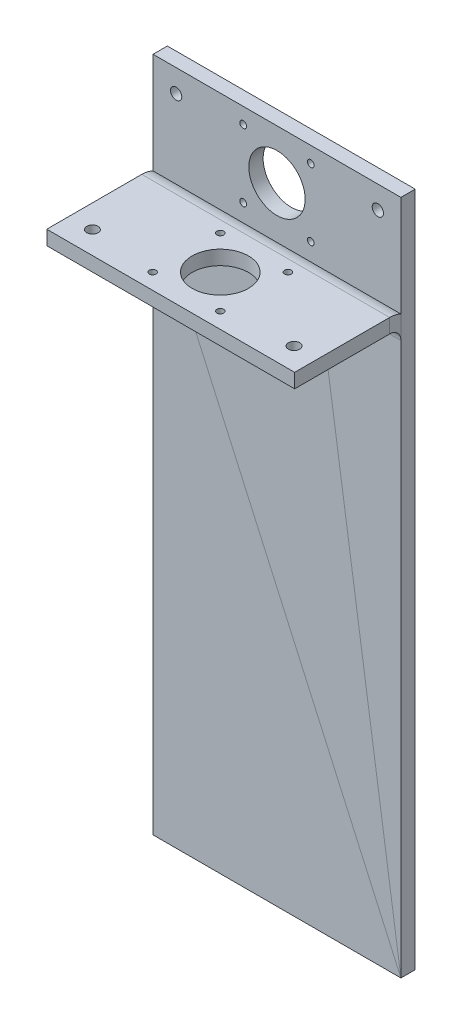
ISO-10303-21;
HEADER;
FILE_DESCRIPTION(('STEP AP214'),'2;1');
FILE_NAME('part.step','',(''),(''),'','','');
FILE_SCHEMA(('AUTOMOTIVE_DESIGN { 1 0 10303 214 1 1 1 1 }'));
ENDSEC;
DATA;
#1=APPLICATION_CONTEXT('core data for automotive mechanical design processes');
#2=APPLICATION_PROTOCOL_DEFINITION('international standard','automotive_design',2000,#1);
#3=PRODUCT_CONTEXT('',#1,'mechanical');
#4=PRODUCT('Part','Part','',(#3));
#5=PRODUCT_RELATED_PRODUCT_CATEGORY('part','',(#4));
#6=PRODUCT_DEFINITION_FORMATION('','',#4);
#7=PRODUCT_DEFINITION_CONTEXT('part definition',#1,'design');
#8=PRODUCT_DEFINITION('design','',#6,#7);
#9=PRODUCT_DEFINITION_SHAPE('','',#8);
#10=(LENGTH_UNIT() NAMED_UNIT(*) SI_UNIT(.MILLI.,.METRE.));
#11=(NAMED_UNIT(*) PLANE_ANGLE_UNIT() SI_UNIT($,.RADIAN.));
#12=(NAMED_UNIT(*) SI_UNIT($,.STERADIAN.) SOLID_ANGLE_UNIT());
#13=UNCERTAINTY_MEASURE_WITH_UNIT(LENGTH_MEASURE(1.E-05),#10,'distance_accuracy_value','');
#14=(GEOMETRIC_REPRESENTATION_CONTEXT(3) GLOBAL_UNCERTAINTY_ASSIGNED_CONTEXT((#13)) GLOBAL_UNIT_ASSIGNED_CONTEXT((#10,
#11,#12)) REPRESENTATION_CONTEXT('',''));
#15=CARTESIAN_POINT('',(0.,0.,0.));
#16=DIRECTION('',(0.,0.,1.));
#17=DIRECTION('',(1.,0.,0.));
#18=AXIS2_PLACEMENT_3D('',#15,#16,#17);
#19=CARTESIAN_POINT('',(0.,256.350000000001,-246.491259971548));
#20=DIRECTION('',(0.,-1.,0.));
#21=DIRECTION('',(1.,0.,0.));
#22=AXIS2_PLACEMENT_3D('',#19,#20,#21);
#23=PLANE('',#22);
#24=CARTESIAN_POINT('',(-99.75,256.35,43.5087400284517));
#25=DIRECTION('',(0.,-1.,0.));
#26=DIRECTION('',(1.,0.,0.));
#27=AXIS2_PLACEMENT_3D('',#24,#25,#26);
#28=CIRCLE('',#27,2.5);
#29=CARTESIAN_POINT('',(-97.25,256.35,43.5087400284517));
#30=VERTEX_POINT('',#29);
#31=EDGE_CURVE('E160',#30,#30,#28,.T.);
#32=ORIENTED_EDGE('',*,*,#31,.T.);
#33=EDGE_LOOP('',(#32));
#34=FACE_BOUND('',#33,.T.);
#35=CARTESIAN_POINT('',(-70.,256.35,46.5087400284517));
#36=DIRECTION('',(0.,-1.,0.));
#37=DIRECTION('',(1.,0.,0.));
#38=AXIS2_PLACEMENT_3D('',#35,#36,#37);
#39=CIRCLE('',#38,1.5);
#40=CARTESIAN_POINT('',(-68.5,256.35,46.5087400284517));
#41=VERTEX_POINT('',#40);
#42=EDGE_CURVE('E163',#41,#41,#39,.T.);
#43=ORIENTED_EDGE('',*,*,#42,.T.);
#44=EDGE_LOOP('',(#43));
#45=FACE_BOUND('',#44,.T.);
#46=CARTESIAN_POINT('',(-40.,256.35,16.5087400284518));
#47=DIRECTION('',(0.,-1.,0.));
#48=DIRECTION('',(1.,0.,0.));
#49=AXIS2_PLACEMENT_3D('',#46,#47,#48);
#50=CIRCLE('',#49,1.5);
#51=CARTESIAN_POINT('',(-38.5,256.35,16.5087400284518));
#52=VERTEX_POINT('',#51);
#53=EDGE_CURVE('E215',#52,#52,#50,.T.);
#54=ORIENTED_EDGE('',*,*,#53,.T.);
#55=EDGE_LOOP('',(#54));
#56=FACE_BOUND('',#55,.T.);
#57=CARTESIAN_POINT('',(-55.,256.35,31.5087400284518));
#58=DIRECTION('',(0.,-1.,0.));
#59=DIRECTION('',(1.,0.,0.));
#60=AXIS2_PLACEMENT_3D('',#57,#58,#59);
#61=CIRCLE('',#60,12.5);
#62=CARTESIAN_POINT('',(-42.5,256.35,31.5087400284518));
#63=VERTEX_POINT('',#62);
#64=EDGE_CURVE('E221',#63,#63,#61,.T.);
#65=ORIENTED_EDGE('',*,*,#64,.T.);
#66=EDGE_LOOP('',(#65));
#67=FACE_BOUND('',#66,.T.);
#68=CARTESIAN_POINT('',(-70.,256.35,16.5087400284518));
#69=DIRECTION('',(0.,-1.,0.));
#70=DIRECTION('',(1.,0.,0.));
#71=AXIS2_PLACEMENT_3D('',#68,#69,#70);
#72=CIRCLE('',#71,1.5);
#73=CARTESIAN_POINT('',(-68.5,256.35,16.5087400284518));
#74=VERTEX_POINT('',#73);
#75=EDGE_CURVE('E224',#74,#74,#72,.T.);
#76=ORIENTED_EDGE('',*,*,#75,.T.);
#77=EDGE_LOOP('',(#76));
#78=FACE_BOUND('',#77,.T.);
#79=CARTESIAN_POINT('',(-40.,256.35,46.5087400284517));
#80=DIRECTION('',(0.,-1.,0.));
#81=DIRECTION('',(1.,0.,0.));
#82=AXIS2_PLACEMENT_3D('',#79,#80,#81);
#83=CIRCLE('',#82,1.5);
#84=CARTESIAN_POINT('',(-38.5,256.35,46.5087400284517));
#85=VERTEX_POINT('',#84);
#86=EDGE_CURVE('E227',#85,#85,#83,.T.);
#87=ORIENTED_EDGE('',*,*,#86,.T.);
#88=EDGE_LOOP('',(#87));
#89=FACE_BOUND('',#88,.T.);
#90=CARTESIAN_POINT('',(-10.25,256.35,43.5087400284517));
#91=DIRECTION('',(0.,-1.,0.));
#92=DIRECTION('',(1.,0.,0.));
#93=AXIS2_PLACEMENT_3D('',#90,#91,#92);
#94=CIRCLE('',#93,2.5);
#95=CARTESIAN_POINT('',(-7.75000000000004,256.35,43.5087400284517));
#96=VERTEX_POINT('',#95);
#97=EDGE_CURVE('E190',#96,#96,#94,.T.);
#98=ORIENTED_EDGE('',*,*,#97,.T.);
#99=EDGE_LOOP('',(#98));
#100=FACE_BOUND('',#99,.T.);
#101=DIRECTION('',(0.,0.,1.));
#102=VECTOR('',#101,1.);
#103=CARTESIAN_POINT('',(0.,256.350000000001,-246.491259971548));
#104=LINE('',#103,#102);
#105=CARTESIAN_POINT('',(0.,256.35,11.3500000000001));
#106=VERTEX_POINT('',#105);
#107=CARTESIAN_POINT('',(0.,256.35,53.5087400284517));
#108=VERTEX_POINT('',#107);
#109=EDGE_CURVE('E75',#106,#108,#104,.T.);
#110=ORIENTED_EDGE('',*,*,#109,.F.);
#111=DIRECTION('',(-1.,0.,0.));
#112=VECTOR('',#111,1.);
#113=CARTESIAN_POINT('',(0.,256.35,11.3500000000001));
#114=LINE('',#113,#112);
#115=CARTESIAN_POINT('',(-110.,256.35,11.3500000000001));
#116=VERTEX_POINT('',#115);
#117=EDGE_CURVE('E67',#106,#116,#114,.T.);
#118=ORIENTED_EDGE('',*,*,#117,.T.);
#119=DIRECTION('',(0.,0.,1.));
#120=VECTOR('',#119,1.);
#121=CARTESIAN_POINT('',(-110.,256.350000000001,-246.491259971548));
#122=LINE('',#121,#120);
#123=CARTESIAN_POINT('',(-110.,256.35,53.5087400284517));
#124=VERTEX_POINT('',#123);
#125=EDGE_CURVE('E83',#124,#116,#122,.F.);
#126=ORIENTED_EDGE('',*,*,#125,.F.);
#127=DIRECTION('',(1.,0.,0.));
#128=VECTOR('',#127,1.);
#129=CARTESIAN_POINT('',(0.,256.35,53.5087400284517));
#130=LINE('',#129,#128);
#131=EDGE_CURVE('E218',#108,#124,#130,.F.);
#132=ORIENTED_EDGE('',*,*,#131,.F.);
#133=EDGE_LOOP('',(#110,#118,#126,#132));
#134=FACE_BOUND('',#133,.T.);
#135=ADVANCED_FACE('F58',(#34,#45,#56,#67,#78,#89,#100,#134),#23,.F.);
#136=CARTESIAN_POINT('',(-110.,250.000000000001,-246.491259971548));
#137=DIRECTION('',(-1.,0.,0.));
#138=DIRECTION('',(0.,0.,-1.));
#139=AXIS2_PLACEMENT_3D('',#136,#137,#138);
#140=PLANE('',#139);
#141=DIRECTION('',(0.,1.,0.));
#142=VECTOR('',#141,1.);
#143=CARTESIAN_POINT('',(-110.,249.999999999998,11.35));
#144=LINE('',#143,#142);
#145=CARTESIAN_POINT('',(-110.,250.,11.35));
#146=VERTEX_POINT('',#145);
#147=EDGE_CURVE('E238',#146,#116,#144,.T.);
#148=ORIENTED_EDGE('',*,*,#147,.F.);
#149=DIRECTION('',(0.,0.,-1.));
#150=VECTOR('',#149,1.);
#151=CARTESIAN_POINT('',(-110.,250.000000000001,-246.491259971548));
#152=LINE('',#151,#150);
#153=CARTESIAN_POINT('',(-110.,250.,53.5087400284517));
#154=VERTEX_POINT('',#153);
#155=EDGE_CURVE('E199',#154,#146,#152,.T.);
#156=ORIENTED_EDGE('',*,*,#155,.F.);
#157=DIRECTION('',(0.,-1.,0.));
#158=VECTOR('',#157,1.);
#159=CARTESIAN_POINT('',(-110.,250.,53.5087400284517));
#160=LINE('',#159,#158);
#161=EDGE_CURVE('E232',#124,#154,#160,.T.);
#162=ORIENTED_EDGE('',*,*,#161,.F.);
#163=ORIENTED_EDGE('',*,*,#125,.T.);
#164=EDGE_LOOP('',(#148,#156,#162,#163));
#165=FACE_BOUND('',#164,.T.);
#166=ADVANCED_FACE('F265',(#165),#140,.T.);
#167=CARTESIAN_POINT('',(0.,250.000000000001,-246.491259971548));
#168=DIRECTION('',(1.,0.,0.));
#169=DIRECTION('',(0.,0.,1.));
#170=AXIS2_PLACEMENT_3D('',#167,#168,#169);
#171=PLANE('',#170);
#172=DIRECTION('',(0.,-1.,0.));
#173=VECTOR('',#172,1.);
#174=CARTESIAN_POINT('',(0.,249.999999999998,11.35));
#175=LINE('',#174,#173);
#176=CARTESIAN_POINT('',(0.,250.,11.35));
#177=VERTEX_POINT('',#176);
#178=EDGE_CURVE('E13',#106,#177,#175,.T.);
#179=ORIENTED_EDGE('',*,*,#178,.F.);
#180=ORIENTED_EDGE('',*,*,#109,.T.);
#181=DIRECTION('',(0.,-1.,0.));
#182=VECTOR('',#181,1.);
#183=CARTESIAN_POINT('',(0.,250.,53.5087400284517));
#184=LINE('',#183,#182);
#185=CARTESIAN_POINT('',(0.,250.,53.5087400284517));
#186=VERTEX_POINT('',#185);
#187=EDGE_CURVE('E211',#108,#186,#184,.T.);
#188=ORIENTED_EDGE('',*,*,#187,.T.);
#189=DIRECTION('',(0.,0.,1.));
#190=VECTOR('',#189,1.);
#191=CARTESIAN_POINT('',(0.,250.000000000001,-246.491259971548));
#192=LINE('',#191,#190);
#193=EDGE_CURVE('E62',#177,#186,#192,.T.);
#194=ORIENTED_EDGE('',*,*,#193,.F.);
#195=EDGE_LOOP('',(#179,#180,#188,#194));
#196=FACE_BOUND('',#195,.T.);
#197=ADVANCED_FACE('F60',(#196),#171,.T.);
#198=CARTESIAN_POINT('',(-99.75,250.,43.5087400284517));
#199=DIRECTION('',(0.,-1.,0.));
#200=DIRECTION('',(1.,0.,0.));
#201=AXIS2_PLACEMENT_3D('',#198,#199,#200);
#202=CYLINDRICAL_SURFACE('',#201,2.5);
#203=CARTESIAN_POINT('',(-99.75,250.,43.5087400284517));
#204=DIRECTION('',(0.,-1.,0.));
#205=DIRECTION('',(1.,0.,0.));
#206=AXIS2_PLACEMENT_3D('',#203,#204,#205);
#207=CIRCLE('',#206,2.5);
#208=CARTESIAN_POINT('',(-97.25,250.,43.5087400284517));
#209=VERTEX_POINT('',#208);
#210=EDGE_CURVE('E186',#209,#209,#207,.T.);
#211=ORIENTED_EDGE('',*,*,#210,.T.);
#212=EDGE_LOOP('',(#211));
#213=FACE_BOUND('',#212,.T.);
#214=ORIENTED_EDGE('',*,*,#31,.F.);
#215=EDGE_LOOP('',(#214));
#216=FACE_BOUND('',#215,.T.);
#217=ADVANCED_FACE('F264',(#213,#216),#202,.F.);
#218=CARTESIAN_POINT('',(-70.,250.,46.5087400284517));
#219=DIRECTION('',(0.,-1.,0.));
#220=DIRECTION('',(1.,0.,0.));
#221=AXIS2_PLACEMENT_3D('',#218,#219,#220);
#222=CYLINDRICAL_SURFACE('',#221,1.5);
#223=CARTESIAN_POINT('',(-70.,250.,46.5087400284517));
#224=DIRECTION('',(0.,-1.,0.));
#225=DIRECTION('',(1.,0.,0.));
#226=AXIS2_PLACEMENT_3D('',#223,#224,#225);
#227=CIRCLE('',#226,1.5);
#228=CARTESIAN_POINT('',(-68.5,250.,46.5087400284517));
#229=VERTEX_POINT('',#228);
#230=EDGE_CURVE('E189',#229,#229,#227,.T.);
#231=ORIENTED_EDGE('',*,*,#230,.T.);
#232=EDGE_LOOP('',(#231));
#233=FACE_BOUND('',#232,.T.);
#234=ORIENTED_EDGE('',*,*,#42,.F.);
#235=EDGE_LOOP('',(#234));
#236=FACE_BOUND('',#235,.T.);
#237=ADVANCED_FACE('F270',(#233,#236),#222,.F.);
#238=CARTESIAN_POINT('',(-40.,250.,16.5087400284518));
#239=DIRECTION('',(0.,-1.,0.));
#240=DIRECTION('',(1.,0.,0.));
#241=AXIS2_PLACEMENT_3D('',#238,#239,#240);
#242=CYLINDRICAL_SURFACE('',#241,1.5);
#243=CARTESIAN_POINT('',(-40.,250.,16.5087400284518));
#244=DIRECTION('',(0.,-1.,0.));
#245=DIRECTION('',(1.,0.,0.));
#246=AXIS2_PLACEMENT_3D('',#243,#244,#245);
#247=CIRCLE('',#246,1.5);
#248=CARTESIAN_POINT('',(-38.5,250.,16.5087400284518));
#249=VERTEX_POINT('',#248);
#250=EDGE_CURVE('E193',#249,#249,#247,.T.);
#251=ORIENTED_EDGE('',*,*,#250,.T.);
#252=EDGE_LOOP('',(#251));
#253=FACE_BOUND('',#252,.T.);
#254=ORIENTED_EDGE('',*,*,#53,.F.);
#255=EDGE_LOOP('',(#254));
#256=FACE_BOUND('',#255,.T.);
#257=ADVANCED_FACE('F301',(#253,#256),#242,.F.);
#258=CARTESIAN_POINT('',(0.,250.,53.5087400284517));
#259=DIRECTION('',(0.,0.,1.));
#260=DIRECTION('',(-1.,0.,0.));
#261=AXIS2_PLACEMENT_3D('',#258,#259,#260);
#262=PLANE('',#261);
#263=ORIENTED_EDGE('',*,*,#131,.T.);
#264=ORIENTED_EDGE('',*,*,#161,.T.);
#265=DIRECTION('',(-1.,0.,0.));
#266=VECTOR('',#265,1.);
#267=CARTESIAN_POINT('',(0.,250.,53.5087400284517));
#268=LINE('',#267,#266);
#269=EDGE_CURVE('E196',#186,#154,#268,.T.);
#270=ORIENTED_EDGE('',*,*,#269,.F.);
#271=ORIENTED_EDGE('',*,*,#187,.F.);
#272=EDGE_LOOP('',(#263,#264,#270,#271));
#273=FACE_BOUND('',#272,.T.);
#274=ADVANCED_FACE('F261',(#273),#262,.T.);
#275=CARTESIAN_POINT('',(-55.,250.,31.5087400284518));
#276=DIRECTION('',(0.,-1.,0.));
#277=DIRECTION('',(1.,0.,0.));
#278=AXIS2_PLACEMENT_3D('',#275,#276,#277);
#279=CYLINDRICAL_SURFACE('',#278,12.5);
#280=CARTESIAN_POINT('',(-55.,250.,31.5087400284518));
#281=DIRECTION('',(0.,-1.,0.));
#282=DIRECTION('',(1.,0.,0.));
#283=AXIS2_PLACEMENT_3D('',#280,#281,#282);
#284=CIRCLE('',#283,12.5);
#285=CARTESIAN_POINT('',(-42.5,250.,31.5087400284518));
#286=VERTEX_POINT('',#285);
#287=EDGE_CURVE('E200',#286,#286,#284,.T.);
#288=ORIENTED_EDGE('',*,*,#287,.T.);
#289=EDGE_LOOP('',(#288));
#290=FACE_BOUND('',#289,.T.);
#291=ORIENTED_EDGE('',*,*,#64,.F.);
#292=EDGE_LOOP('',(#291));
#293=FACE_BOUND('',#292,.T.);
#294=ADVANCED_FACE('F294',(#290,#293),#279,.F.);
#295=CARTESIAN_POINT('',(-70.,250.,16.5087400284518));
#296=DIRECTION('',(0.,-1.,0.));
#297=DIRECTION('',(1.,0.,0.));
#298=AXIS2_PLACEMENT_3D('',#295,#296,#297);
#299=CYLINDRICAL_SURFACE('',#298,1.5);
#300=CARTESIAN_POINT('',(-70.,250.,16.5087400284518));
#301=DIRECTION('',(0.,-1.,0.));
#302=DIRECTION('',(1.,0.,0.));
#303=AXIS2_PLACEMENT_3D('',#300,#301,#302);
#304=CIRCLE('',#303,1.5);
#305=CARTESIAN_POINT('',(-68.5,250.,16.5087400284518));
#306=VERTEX_POINT('',#305);
#307=EDGE_CURVE('E203',#306,#306,#304,.T.);
#308=ORIENTED_EDGE('',*,*,#307,.T.);
#309=EDGE_LOOP('',(#308));
#310=FACE_BOUND('',#309,.T.);
#311=ORIENTED_EDGE('',*,*,#75,.F.);
#312=EDGE_LOOP('',(#311));
#313=FACE_BOUND('',#312,.T.);
#314=ADVANCED_FACE('F290',(#310,#313),#299,.F.);
#315=CARTESIAN_POINT('',(-40.,250.,46.5087400284517));
#316=DIRECTION('',(0.,-1.,0.));
#317=DIRECTION('',(1.,0.,0.));
#318=AXIS2_PLACEMENT_3D('',#315,#316,#317);
#319=CYLINDRICAL_SURFACE('',#318,1.5);
#320=CARTESIAN_POINT('',(-40.,250.,46.5087400284517));
#321=DIRECTION('',(0.,-1.,0.));
#322=DIRECTION('',(1.,0.,0.));
#323=AXIS2_PLACEMENT_3D('',#320,#321,#322);
#324=CIRCLE('',#323,1.5);
#325=CARTESIAN_POINT('',(-38.5,250.,46.5087400284517));
#326=VERTEX_POINT('',#325);
#327=EDGE_CURVE('E206',#326,#326,#324,.T.);
#328=ORIENTED_EDGE('',*,*,#327,.T.);
#329=EDGE_LOOP('',(#328));
#330=FACE_BOUND('',#329,.T.);
#331=ORIENTED_EDGE('',*,*,#86,.F.);
#332=EDGE_LOOP('',(#331));
#333=FACE_BOUND('',#332,.T.);
#334=ADVANCED_FACE('F286',(#330,#333),#319,.F.);
#335=CARTESIAN_POINT('',(-10.25,250.,43.5087400284517));
#336=DIRECTION('',(0.,-1.,0.));
#337=DIRECTION('',(1.,0.,0.));
#338=AXIS2_PLACEMENT_3D('',#335,#336,#337);
#339=CYLINDRICAL_SURFACE('',#338,2.5);
#340=CARTESIAN_POINT('',(-10.25,250.,43.5087400284517));
#341=DIRECTION('',(0.,-1.,0.));
#342=DIRECTION('',(1.,0.,0.));
#343=AXIS2_PLACEMENT_3D('',#340,#341,#342);
#344=CIRCLE('',#343,2.5);
#345=CARTESIAN_POINT('',(-7.75000000000004,250.,43.5087400284517));
#346=VERTEX_POINT('',#345);
#347=EDGE_CURVE('E209',#346,#346,#344,.T.);
#348=ORIENTED_EDGE('',*,*,#347,.T.);
#349=EDGE_LOOP('',(#348));
#350=FACE_BOUND('',#349,.T.);
#351=ORIENTED_EDGE('',*,*,#97,.F.);
#352=EDGE_LOOP('',(#351));
#353=FACE_BOUND('',#352,.T.);
#354=ADVANCED_FACE('F283',(#350,#353),#339,.F.);
#355=CARTESIAN_POINT('',(0.,250.000000000001,-246.491259971548));
#356=DIRECTION('',(0.,-1.,0.));
#357=DIRECTION('',(1.,0.,0.));
#358=AXIS2_PLACEMENT_3D('',#355,#356,#357);
#359=PLANE('',#358);
#360=DIRECTION('',(-1.,0.,0.));
#361=VECTOR('',#360,1.);
#362=CARTESIAN_POINT('',(0.,250.,11.35));
#363=LINE('',#362,#361);
#364=EDGE_CURVE('E234',#177,#146,#363,.T.);
#365=ORIENTED_EDGE('',*,*,#364,.F.);
#366=ORIENTED_EDGE('',*,*,#193,.T.);
#367=ORIENTED_EDGE('',*,*,#269,.T.);
#368=ORIENTED_EDGE('',*,*,#155,.T.);
#369=EDGE_LOOP('',(#365,#366,#367,#368));
#370=FACE_BOUND('',#369,.T.);
#371=ORIENTED_EDGE('',*,*,#210,.F.);
#372=EDGE_LOOP('',(#371));
#373=FACE_BOUND('',#372,.T.);
#374=ORIENTED_EDGE('',*,*,#230,.F.);
#375=EDGE_LOOP('',(#374));
#376=FACE_BOUND('',#375,.T.);
#377=ORIENTED_EDGE('',*,*,#250,.F.);
#378=EDGE_LOOP('',(#377));
#379=FACE_BOUND('',#378,.T.);
#380=ORIENTED_EDGE('',*,*,#287,.F.);
#381=EDGE_LOOP('',(#380));
#382=FACE_BOUND('',#381,.T.);
#383=ORIENTED_EDGE('',*,*,#307,.F.);
#384=EDGE_LOOP('',(#383));
#385=FACE_BOUND('',#384,.T.);
#386=ORIENTED_EDGE('',*,*,#327,.F.);
#387=EDGE_LOOP('',(#386));
#388=FACE_BOUND('',#387,.T.);
#389=ORIENTED_EDGE('',*,*,#347,.F.);
#390=EDGE_LOOP('',(#389));
#391=FACE_BOUND('',#390,.T.);
#392=ADVANCED_FACE('F246',(#370,#373,#376,#379,#382,#385,#388,#391),#359,.T.);
#393=CARTESIAN_POINT('',(0.,0.,6.35));
#394=DIRECTION('',(0.,-1.,0.));
#395=DIRECTION('',(1.,0.,0.));
#396=AXIS2_PLACEMENT_3D('',#393,#394,#395);
#397=PLANE('',#396);
#398=DIRECTION('',(0.,0.,1.));
#399=VECTOR('',#398,1.);
#400=CARTESIAN_POINT('',(-110.,0.,6.35));
#401=LINE('',#400,#399);
#402=CARTESIAN_POINT('',(-110.,0.,0.));
#403=VERTEX_POINT('',#402);
#404=CARTESIAN_POINT('',(-110.,0.,6.35));
#405=VERTEX_POINT('',#404);
#406=EDGE_CURVE('E165',#403,#405,#401,.T.);
#407=ORIENTED_EDGE('',*,*,#406,.F.);
#408=DIRECTION('',(1.,0.,0.));
#409=VECTOR('',#408,1.);
#410=CARTESIAN_POINT('',(0.,0.,0.));
#411=LINE('',#410,#409);
#412=CARTESIAN_POINT('',(0.,0.,0.));
#413=VERTEX_POINT('',#412);
#414=EDGE_CURVE('E181',#403,#413,#411,.T.);
#415=ORIENTED_EDGE('',*,*,#414,.T.);
#416=DIRECTION('',(0.,0.,1.));
#417=VECTOR('',#416,1.);
#418=CARTESIAN_POINT('',(0.,0.,6.35));
#419=LINE('',#418,#417);
#420=CARTESIAN_POINT('',(0.,0.,6.35));
#421=VERTEX_POINT('',#420);
#422=EDGE_CURVE('E153',#413,#421,#419,.T.);
#423=ORIENTED_EDGE('',*,*,#422,.T.);
#424=DIRECTION('',(1.,0.,0.));
#425=VECTOR('',#424,1.);
#426=CARTESIAN_POINT('',(0.,0.,6.35));
#427=LINE('',#426,#425);
#428=EDGE_CURVE('E151',#405,#421,#427,.T.);
#429=ORIENTED_EDGE('',*,*,#428,.F.);
#430=EDGE_LOOP('',(#407,#415,#423,#429));
#431=FACE_BOUND('',#430,.T.);
#432=ADVANCED_FACE('F282',(#431),#397,.T.);
#433=CARTESIAN_POINT('',(0.,0.,6.35));
#434=DIRECTION('',(0.,0.,1.));
#435=DIRECTION('',(1.,0.,0.));
#436=AXIS2_PLACEMENT_3D('',#433,#434,#435);
#437=PLANE('',#436);
#438=DIRECTION('',(0.,1.,0.));
#439=VECTOR('',#438,1.);
#440=CARTESIAN_POINT('',(0.,0.,6.35));
#441=LINE('',#440,#439);
#442=CARTESIAN_POINT('',(0.,245.,6.35000000000001));
#443=VERTEX_POINT('',#442);
#444=EDGE_CURVE('E145',#421,#443,#441,.T.);
#445=ORIENTED_EDGE('',*,*,#444,.T.);
#446=DIRECTION('',(-1.,0.,0.));
#447=VECTOR('',#446,1.);
#448=CARTESIAN_POINT('',(0.,245.,6.35));
#449=LINE('',#448,#447);
#450=CARTESIAN_POINT('',(-110.,245.,6.35000000000001));
#451=VERTEX_POINT('',#450);
#452=EDGE_CURVE('E138',#443,#451,#449,.T.);
#453=ORIENTED_EDGE('',*,*,#452,.T.);
#454=DIRECTION('',(0.,-1.,0.));
#455=VECTOR('',#454,1.);
#456=CARTESIAN_POINT('',(-110.,0.,6.35));
#457=LINE('',#456,#455);
#458=EDGE_CURVE('E144',#451,#405,#457,.T.);
#459=ORIENTED_EDGE('',*,*,#458,.T.);
#460=ORIENTED_EDGE('',*,*,#428,.T.);
#461=EDGE_LOOP('',(#445,#453,#459,#460));
#462=FACE_BOUND('',#461,.T.);
#463=ADVANCED_FACE('F149',(#462),#437,.T.);
#464=CARTESIAN_POINT('',(-110.,0.,6.35));
#465=DIRECTION('',(-1.,0.,0.));
#466=DIRECTION('',(0.,-1.,0.));
#467=AXIS2_PLACEMENT_3D('',#464,#465,#466);
#468=PLANE('',#467);
#469=ORIENTED_EDGE('',*,*,#458,.F.);
#470=DIRECTION('',(0.,0.,-1.));
#471=VECTOR('',#470,1.);
#472=CARTESIAN_POINT('',(-110.,245.,6.35000000000171));
#473=LINE('',#472,#471);
#474=CARTESIAN_POINT('',(-110.,245.,0.));
#475=VERTEX_POINT('',#474);
#476=EDGE_CURVE('E175',#451,#475,#473,.T.);
#477=ORIENTED_EDGE('',*,*,#476,.T.);
#478=DIRECTION('',(0.,1.,0.));
#479=VECTOR('',#478,1.);
#480=CARTESIAN_POINT('',(-110.,0.,0.));
#481=LINE('',#480,#479);
#482=EDGE_CURVE('E173',#475,#403,#481,.F.);
#483=ORIENTED_EDGE('',*,*,#482,.T.);
#484=ORIENTED_EDGE('',*,*,#406,.T.);
#485=EDGE_LOOP('',(#469,#477,#483,#484));
#486=FACE_BOUND('',#485,.T.);
#487=ADVANCED_FACE('F313',(#486),#468,.T.);
#488=CARTESIAN_POINT('',(0.,0.,0.));
#489=DIRECTION('',(0.,0.,1.));
#490=DIRECTION('',(1.,0.,0.));
#491=AXIS2_PLACEMENT_3D('',#488,#489,#490);
#492=PLANE('',#491);
#493=DIRECTION('',(-1.,0.,0.));
#494=VECTOR('',#493,1.);
#495=CARTESIAN_POINT('',(0.,245.,0.));
#496=LINE('',#495,#494);
#497=CARTESIAN_POINT('',(0.,245.,0.));
#498=VERTEX_POINT('',#497);
#499=EDGE_CURVE('E184',#498,#475,#496,.T.);
#500=ORIENTED_EDGE('',*,*,#499,.F.);
#501=DIRECTION('',(0.,1.,0.));
#502=VECTOR('',#501,1.);
#503=CARTESIAN_POINT('',(0.,0.,0.));
#504=LINE('',#503,#502);
#505=EDGE_CURVE('E158',#413,#498,#504,.T.);
#506=ORIENTED_EDGE('',*,*,#505,.F.);
#507=ORIENTED_EDGE('',*,*,#414,.F.);
#508=ORIENTED_EDGE('',*,*,#482,.F.);
#509=EDGE_LOOP('',(#500,#506,#507,#508));
#510=FACE_BOUND('',#509,.T.);
#511=ADVANCED_FACE('F310',(#510),#492,.F.);
#512=CARTESIAN_POINT('',(0.,0.,6.35));
#513=DIRECTION('',(1.,0.,0.));
#514=DIRECTION('',(0.,1.,0.));
#515=AXIS2_PLACEMENT_3D('',#512,#513,#514);
#516=PLANE('',#515);
#517=ORIENTED_EDGE('',*,*,#505,.T.);
#518=DIRECTION('',(0.,0.,1.));
#519=VECTOR('',#518,1.);
#520=CARTESIAN_POINT('',(0.,245.,6.35000000000171));
#521=LINE('',#520,#519);
#522=EDGE_CURVE('E129',#498,#443,#521,.T.);
#523=ORIENTED_EDGE('',*,*,#522,.T.);
#524=ORIENTED_EDGE('',*,*,#444,.F.);
#525=ORIENTED_EDGE('',*,*,#422,.F.);
#526=EDGE_LOOP('',(#517,#523,#524,#525));
#527=FACE_BOUND('',#526,.T.);
#528=ADVANCED_FACE('F156',(#527),#516,.T.);
#529=CARTESIAN_POINT('',(0.,245.,11.35));
#530=DIRECTION('',(-1.,0.,0.));
#531=DIRECTION('',(0.,0.,1.));
#532=AXIS2_PLACEMENT_3D('',#529,#530,#531);
#533=PLANE('',#532);
#534=ORIENTED_EDGE('',*,*,#522,.F.);
#535=CARTESIAN_POINT('',(0.,245.,11.35));
#536=DIRECTION('',(-1.,0.,0.));
#537=DIRECTION('',(0.,0.,1.));
#538=AXIS2_PLACEMENT_3D('',#535,#536,#537);
#539=CIRCLE('',#538,11.35);
#540=EDGE_CURVE('E168',#498,#106,#539,.F.);
#541=ORIENTED_EDGE('',*,*,#540,.T.);
#542=ORIENTED_EDGE('',*,*,#178,.T.);
#543=CARTESIAN_POINT('',(0.,245.,11.35));
#544=DIRECTION('',(1.,0.,0.));
#545=DIRECTION('',(0.,0.,-1.));
#546=AXIS2_PLACEMENT_3D('',#543,#544,#545);
#547=CIRCLE('',#546,4.99999999999999);
#548=EDGE_CURVE('E124',#443,#177,#547,.T.);
#549=ORIENTED_EDGE('',*,*,#548,.F.);
#550=EDGE_LOOP('',(#534,#541,#542,#549));
#551=FACE_BOUND('',#550,.T.);
#552=ADVANCED_FACE('F126',(#551),#533,.F.);
#553=CARTESIAN_POINT('',(-110.,245.,11.35));
#554=DIRECTION('',(1.,0.,0.));
#555=DIRECTION('',(0.,0.,-1.));
#556=AXIS2_PLACEMENT_3D('',#553,#554,#555);
#557=PLANE('',#556);
#558=ORIENTED_EDGE('',*,*,#147,.T.);
#559=CARTESIAN_POINT('',(-110.,245.,11.35));
#560=DIRECTION('',(-1.,0.,0.));
#561=DIRECTION('',(0.,0.,1.));
#562=AXIS2_PLACEMENT_3D('',#559,#560,#561);
#563=CIRCLE('',#562,11.35);
#564=EDGE_CURVE('E134',#116,#475,#563,.T.);
#565=ORIENTED_EDGE('',*,*,#564,.T.);
#566=ORIENTED_EDGE('',*,*,#476,.F.);
#567=CARTESIAN_POINT('',(-110.,245.,11.35));
#568=DIRECTION('',(-1.,0.,0.));
#569=DIRECTION('',(0.,0.,1.));
#570=AXIS2_PLACEMENT_3D('',#567,#568,#569);
#571=CIRCLE('',#570,4.99999999999999);
#572=EDGE_CURVE('E133',#146,#451,#571,.T.);
#573=ORIENTED_EDGE('',*,*,#572,.F.);
#574=EDGE_LOOP('',(#558,#565,#566,#573));
#575=FACE_BOUND('',#574,.T.);
#576=ADVANCED_FACE('F251',(#575),#557,.F.);
#577=CARTESIAN_POINT('',(55.9288982080723,245.,11.35));
#578=DIRECTION('',(-1.,0.,0.));
#579=DIRECTION('',(0.,0.,1.));
#580=AXIS2_PLACEMENT_3D('',#577,#578,#579);
#581=CYLINDRICAL_SURFACE('',#580,5.);
#582=ORIENTED_EDGE('',*,*,#572,.T.);
#583=ORIENTED_EDGE('',*,*,#452,.F.);
#584=ORIENTED_EDGE('',*,*,#548,.T.);
#585=ORIENTED_EDGE('',*,*,#364,.T.);
#586=EDGE_LOOP('',(#582,#583,#584,#585));
#587=FACE_BOUND('',#586,.T.);
#588=ADVANCED_FACE('F140',(#587),#581,.F.);
#589=CARTESIAN_POINT('',(55.9288982080723,245.,11.35));
#590=DIRECTION('',(-1.,0.,0.));
#591=DIRECTION('',(0.,0.,1.));
#592=AXIS2_PLACEMENT_3D('',#589,#590,#591);
#593=CYLINDRICAL_SURFACE('',#592,11.35);
#594=ORIENTED_EDGE('',*,*,#564,.F.);
#595=ORIENTED_EDGE('',*,*,#117,.F.);
#596=ORIENTED_EDGE('',*,*,#540,.F.);
#597=ORIENTED_EDGE('',*,*,#499,.T.);
#598=EDGE_LOOP('',(#594,#595,#596,#597));
#599=FACE_BOUND('',#598,.T.);
#600=ADVANCED_FACE('F258',(#599),#593,.T.);
#601=CLOSED_SHELL('',(#135,#166,#197,#217,#237,#257,#274,#294,#314,#334,#354,#392,#432,#463,
#487,#511,#528,#552,#576,#588,#600));
#602=MANIFOLD_SOLID_BREP('B2',#601);
#603=CARTESIAN_POINT('',(0.,0.,6.35));
#604=DIRECTION('',(0.,0.,1.));
#605=DIRECTION('',(1.,0.,0.));
#606=AXIS2_PLACEMENT_3D('',#603,#604,#605);
#607=PLANE('',#606);
#608=CARTESIAN_POINT('',(-99.75,290.,6.35));
#609=DIRECTION('',(0.,0.,1.));
#610=DIRECTION('',(1.,0.,0.));
#611=AXIS2_PLACEMENT_3D('',#608,#609,#610);
#612=CIRCLE('',#611,2.5);
#613=CARTESIAN_POINT('',(-97.25,290.,6.35));
#614=VERTEX_POINT('',#613);
#615=EDGE_CURVE('E683',#614,#614,#612,.T.);
#616=ORIENTED_EDGE('',*,*,#615,.F.);
#617=EDGE_LOOP('',(#616));
#618=FACE_BOUND('',#617,.T.);
#619=CARTESIAN_POINT('',(-70.,293.,6.35));
#620=DIRECTION('',(0.,0.,1.));
#621=DIRECTION('',(1.,0.,0.));
#622=AXIS2_PLACEMENT_3D('',#619,#620,#621);
#623=CIRCLE('',#622,1.5);
#624=CARTESIAN_POINT('',(-68.5,293.,6.35));
#625=VERTEX_POINT('',#624);
#626=EDGE_CURVE('E669',#625,#625,#623,.T.);
#627=ORIENTED_EDGE('',*,*,#626,.F.);
#628=EDGE_LOOP('',(#627));
#629=FACE_BOUND('',#628,.T.);
#630=CARTESIAN_POINT('',(-40.,263.,6.35));
#631=DIRECTION('',(0.,0.,1.));
#632=DIRECTION('',(1.,0.,0.));
#633=AXIS2_PLACEMENT_3D('',#630,#631,#632);
#634=CIRCLE('',#633,1.5);
#635=CARTESIAN_POINT('',(-38.5,263.,6.35));
#636=VERTEX_POINT('',#635);
#637=EDGE_CURVE('E656',#636,#636,#634,.T.);
#638=ORIENTED_EDGE('',*,*,#637,.F.);
#639=EDGE_LOOP('',(#638));
#640=FACE_BOUND('',#639,.T.);
#641=DIRECTION('',(0.,1.,0.));
#642=VECTOR('',#641,1.);
#643=CARTESIAN_POINT('',(0.,0.,6.35));
#644=LINE('',#643,#642);
#645=CARTESIAN_POINT('',(0.,0.,6.35));
#646=VERTEX_POINT('',#645);
#647=CARTESIAN_POINT('',(0.,300.,6.35));
#648=VERTEX_POINT('',#647);
#649=EDGE_CURVE('E621',#646,#648,#644,.T.);
#650=ORIENTED_EDGE('',*,*,#649,.T.);
#651=DIRECTION('',(-1.,0.,0.));
#652=VECTOR('',#651,1.);
#653=CARTESIAN_POINT('',(0.,300.,6.35));
#654=LINE('',#653,#652);
#655=CARTESIAN_POINT('',(-110.,300.,6.35));
#656=VERTEX_POINT('',#655);
#657=EDGE_CURVE('E616',#648,#656,#654,.T.);
#658=ORIENTED_EDGE('',*,*,#657,.T.);
#659=DIRECTION('',(0.,-1.,0.));
#660=VECTOR('',#659,1.);
#661=CARTESIAN_POINT('',(-110.,0.,6.35));
#662=LINE('',#661,#660);
#663=CARTESIAN_POINT('',(-110.,0.,6.35));
#664=VERTEX_POINT('',#663);
#665=EDGE_CURVE('E619',#656,#664,#662,.T.);
#666=ORIENTED_EDGE('',*,*,#665,.T.);
#667=DIRECTION('',(1.,0.,0.));
#668=VECTOR('',#667,1.);
#669=CARTESIAN_POINT('',(0.,0.,6.35));
#670=LINE('',#669,#668);
#671=EDGE_CURVE('E586',#664,#646,#670,.T.);
#672=ORIENTED_EDGE('',*,*,#671,.T.);
#673=EDGE_LOOP('',(#650,#658,#666,#672));
#674=FACE_BOUND('',#673,.T.);
#675=CARTESIAN_POINT('',(-55.,278.,6.35));
#676=DIRECTION('',(0.,0.,1.));
#677=DIRECTION('',(1.,0.,0.));
#678=AXIS2_PLACEMENT_3D('',#675,#676,#677);
#679=CIRCLE('',#678,12.5);
#680=CARTESIAN_POINT('',(-42.5,278.,6.35));
#681=VERTEX_POINT('',#680);
#682=EDGE_CURVE('E639',#681,#681,#679,.T.);
#683=ORIENTED_EDGE('',*,*,#682,.F.);
#684=EDGE_LOOP('',(#683));
#685=FACE_BOUND('',#684,.T.);
#686=CARTESIAN_POINT('',(-70.,263.,6.35));
#687=DIRECTION('',(0.,0.,1.));
#688=DIRECTION('',(1.,0.,0.));
#689=AXIS2_PLACEMENT_3D('',#686,#687,#688);
#690=CIRCLE('',#689,1.5);
#691=CARTESIAN_POINT('',(-68.5,263.,6.35));
#692=VERTEX_POINT('',#691);
#693=EDGE_CURVE('E663',#692,#692,#690,.T.);
#694=ORIENTED_EDGE('',*,*,#693,.F.);
#695=EDGE_LOOP('',(#694));
#696=FACE_BOUND('',#695,.T.);
#697=CARTESIAN_POINT('',(-40.,293.,6.35));
#698=DIRECTION('',(0.,0.,1.));
#699=DIRECTION('',(1.,0.,0.));
#700=AXIS2_PLACEMENT_3D('',#697,#698,#699);
#701=CIRCLE('',#700,1.5);
#702=CARTESIAN_POINT('',(-38.5,293.,6.35));
#703=VERTEX_POINT('',#702);
#704=EDGE_CURVE('E676',#703,#703,#701,.T.);
#705=ORIENTED_EDGE('',*,*,#704,.F.);
#706=EDGE_LOOP('',(#705));
#707=FACE_BOUND('',#706,.T.);
#708=CARTESIAN_POINT('',(-10.25,290.,6.35));
#709=DIRECTION('',(0.,0.,1.));
#710=DIRECTION('',(1.,0.,0.));
#711=AXIS2_PLACEMENT_3D('',#708,#709,#710);
#712=CIRCLE('',#711,2.5);
#713=CARTESIAN_POINT('',(-7.75000000000004,290.,6.35));
#714=VERTEX_POINT('',#713);
#715=EDGE_CURVE('E690',#714,#714,#712,.T.);
#716=ORIENTED_EDGE('',*,*,#715,.F.);
#717=EDGE_LOOP('',(#716));
#718=FACE_BOUND('',#717,.T.);
#719=ADVANCED_FACE('F569',(#618,#629,#640,#674,#685,#696,#707,#718),#607,.T.);
#720=CARTESIAN_POINT('',(0.,0.,0.));
#721=DIRECTION('',(0.,0.,1.));
#722=DIRECTION('',(1.,0.,0.));
#723=AXIS2_PLACEMENT_3D('',#720,#721,#722);
#724=PLANE('',#723);
#725=DIRECTION('',(0.,1.,0.));
#726=VECTOR('',#725,1.);
#727=CARTESIAN_POINT('',(0.,0.,0.));
#728=LINE('',#727,#726);
#729=CARTESIAN_POINT('',(0.,0.,0.));
#730=VERTEX_POINT('',#729);
#731=CARTESIAN_POINT('',(0.,300.,0.));
#732=VERTEX_POINT('',#731);
#733=EDGE_CURVE('E636',#730,#732,#728,.T.);
#734=ORIENTED_EDGE('',*,*,#733,.F.);
#735=DIRECTION('',(1.,0.,0.));
#736=VECTOR('',#735,1.);
#737=CARTESIAN_POINT('',(0.,0.,0.));
#738=LINE('',#737,#736);
#739=CARTESIAN_POINT('',(-110.,0.,0.));
#740=VERTEX_POINT('',#739);
#741=EDGE_CURVE('E609',#740,#730,#738,.T.);
#742=ORIENTED_EDGE('',*,*,#741,.F.);
#743=DIRECTION('',(0.,-1.,0.));
#744=VECTOR('',#743,1.);
#745=CARTESIAN_POINT('',(-110.,0.,0.));
#746=LINE('',#745,#744);
#747=CARTESIAN_POINT('',(-110.,300.,0.));
#748=VERTEX_POINT('',#747);
#749=EDGE_CURVE('E603',#748,#740,#746,.T.);
#750=ORIENTED_EDGE('',*,*,#749,.F.);
#751=DIRECTION('',(-1.,0.,0.));
#752=VECTOR('',#751,1.);
#753=CARTESIAN_POINT('',(0.,300.,0.));
#754=LINE('',#753,#752);
#755=EDGE_CURVE('E626',#732,#748,#754,.T.);
#756=ORIENTED_EDGE('',*,*,#755,.F.);
#757=EDGE_LOOP('',(#734,#742,#750,#756));
#758=FACE_BOUND('',#757,.T.);
#759=CARTESIAN_POINT('',(-55.,278.,0.));
#760=DIRECTION('',(0.,0.,1.));
#761=DIRECTION('',(1.,0.,0.));
#762=AXIS2_PLACEMENT_3D('',#759,#760,#761);
#763=CIRCLE('',#762,12.5);
#764=CARTESIAN_POINT('',(-42.5,278.,0.));
#765=VERTEX_POINT('',#764);
#766=EDGE_CURVE('E653',#765,#765,#763,.T.);
#767=ORIENTED_EDGE('',*,*,#766,.T.);
#768=EDGE_LOOP('',(#767));
#769=FACE_BOUND('',#768,.T.);
#770=CARTESIAN_POINT('',(-40.,263.,0.));
#771=DIRECTION('',(0.,0.,1.));
#772=DIRECTION('',(1.,0.,0.));
#773=AXIS2_PLACEMENT_3D('',#770,#771,#772);
#774=CIRCLE('',#773,1.5);
#775=CARTESIAN_POINT('',(-38.5,263.,0.));
#776=VERTEX_POINT('',#775);
#777=EDGE_CURVE('E660',#776,#776,#774,.T.);
#778=ORIENTED_EDGE('',*,*,#777,.T.);
#779=EDGE_LOOP('',(#778));
#780=FACE_BOUND('',#779,.T.);
#781=CARTESIAN_POINT('',(-70.,263.,0.));
#782=DIRECTION('',(0.,0.,1.));
#783=DIRECTION('',(1.,0.,0.));
#784=AXIS2_PLACEMENT_3D('',#781,#782,#783);
#785=CIRCLE('',#784,1.5);
#786=CARTESIAN_POINT('',(-68.5,263.,0.));
#787=VERTEX_POINT('',#786);
#788=EDGE_CURVE('E666',#787,#787,#785,.T.);
#789=ORIENTED_EDGE('',*,*,#788,.T.);
#790=EDGE_LOOP('',(#789));
#791=FACE_BOUND('',#790,.T.);
#792=CARTESIAN_POINT('',(-70.,293.,0.));
#793=DIRECTION('',(0.,0.,1.));
#794=DIRECTION('',(1.,0.,0.));
#795=AXIS2_PLACEMENT_3D('',#792,#793,#794);
#796=CIRCLE('',#795,1.5);
#797=CARTESIAN_POINT('',(-68.5,293.,0.));
#798=VERTEX_POINT('',#797);
#799=EDGE_CURVE('E673',#798,#798,#796,.T.);
#800=ORIENTED_EDGE('',*,*,#799,.T.);
#801=EDGE_LOOP('',(#800));
#802=FACE_BOUND('',#801,.T.);
#803=CARTESIAN_POINT('',(-40.,293.,0.));
#804=DIRECTION('',(0.,0.,1.));
#805=DIRECTION('',(1.,0.,0.));
#806=AXIS2_PLACEMENT_3D('',#803,#804,#805);
#807=CIRCLE('',#806,1.5);
#808=CARTESIAN_POINT('',(-38.5,293.,0.));
#809=VERTEX_POINT('',#808);
#810=EDGE_CURVE('E680',#809,#809,#807,.T.);
#811=ORIENTED_EDGE('',*,*,#810,.T.);
#812=EDGE_LOOP('',(#811));
#813=FACE_BOUND('',#812,.T.);
#814=CARTESIAN_POINT('',(-99.75,290.,0.));
#815=DIRECTION('',(0.,0.,1.));
#816=DIRECTION('',(1.,0.,0.));
#817=AXIS2_PLACEMENT_3D('',#814,#815,#816);
#818=CIRCLE('',#817,2.5);
#819=CARTESIAN_POINT('',(-97.25,290.,0.));
#820=VERTEX_POINT('',#819);
#821=EDGE_CURVE('E687',#820,#820,#818,.T.);
#822=ORIENTED_EDGE('',*,*,#821,.T.);
#823=EDGE_LOOP('',(#822));
#824=FACE_BOUND('',#823,.T.);
#825=CARTESIAN_POINT('',(-10.25,290.,0.));
#826=DIRECTION('',(0.,0.,1.));
#827=DIRECTION('',(1.,0.,0.));
#828=AXIS2_PLACEMENT_3D('',#825,#826,#827);
#829=CIRCLE('',#828,2.5);
#830=CARTESIAN_POINT('',(-7.75000000000004,290.,0.));
#831=VERTEX_POINT('',#830);
#832=EDGE_CURVE('E694',#831,#831,#829,.T.);
#833=ORIENTED_EDGE('',*,*,#832,.T.);
#834=EDGE_LOOP('',(#833));
#835=FACE_BOUND('',#834,.T.);
#836=ADVANCED_FACE('F647',(#758,#769,#780,#791,#802,#813,#824,#835),#724,.F.);
#837=CARTESIAN_POINT('',(0.,0.,6.35));
#838=DIRECTION('',(-1.,0.,0.));
#839=DIRECTION('',(0.,0.,1.));
#840=AXIS2_PLACEMENT_3D('',#837,#838,#839);
#841=PLANE('',#840);
#842=ORIENTED_EDGE('',*,*,#733,.T.);
#843=DIRECTION('',(0.,0.,-1.));
#844=VECTOR('',#843,1.);
#845=CARTESIAN_POINT('',(0.,300.,6.35));
#846=LINE('',#845,#844);
#847=EDGE_CURVE('E56',#648,#732,#846,.T.);
#848=ORIENTED_EDGE('',*,*,#847,.F.);
#849=ORIENTED_EDGE('',*,*,#649,.F.);
#850=DIRECTION('',(0.,0.,-1.));
#851=VECTOR('',#850,1.);
#852=CARTESIAN_POINT('',(0.,0.,6.35));
#853=LINE('',#852,#851);
#854=EDGE_CURVE('E632',#646,#730,#853,.T.);
#855=ORIENTED_EDGE('',*,*,#854,.T.);
#856=EDGE_LOOP('',(#842,#848,#849,#855));
#857=FACE_BOUND('',#856,.T.);
#858=ADVANCED_FACE('F571',(#857),#841,.F.);
#859=CARTESIAN_POINT('',(0.,300.,6.35));
#860=DIRECTION('',(0.,-1.,0.));
#861=DIRECTION('',(0.,0.,-1.));
#862=AXIS2_PLACEMENT_3D('',#859,#860,#861);
#863=PLANE('',#862);
#864=ORIENTED_EDGE('',*,*,#755,.T.);
#865=DIRECTION('',(0.,0.,-1.));
#866=VECTOR('',#865,1.);
#867=CARTESIAN_POINT('',(-110.,300.,6.35));
#868=LINE('',#867,#866);
#869=EDGE_CURVE('E578',#656,#748,#868,.T.);
#870=ORIENTED_EDGE('',*,*,#869,.F.);
#871=ORIENTED_EDGE('',*,*,#657,.F.);
#872=ORIENTED_EDGE('',*,*,#847,.T.);
#873=EDGE_LOOP('',(#864,#870,#871,#872));
#874=FACE_BOUND('',#873,.T.);
#875=ADVANCED_FACE('F625',(#874),#863,.F.);
#876=CARTESIAN_POINT('',(-110.,0.,6.35));
#877=DIRECTION('',(1.,0.,0.));
#878=DIRECTION('',(0.,1.,0.));
#879=AXIS2_PLACEMENT_3D('',#876,#877,#878);
#880=PLANE('',#879);
#881=ORIENTED_EDGE('',*,*,#749,.T.);
#882=DIRECTION('',(0.,0.,-1.));
#883=VECTOR('',#882,1.);
#884=CARTESIAN_POINT('',(-110.,0.,6.35));
#885=LINE('',#884,#883);
#886=EDGE_CURVE('E627',#664,#740,#885,.T.);
#887=ORIENTED_EDGE('',*,*,#886,.F.);
#888=ORIENTED_EDGE('',*,*,#665,.F.);
#889=ORIENTED_EDGE('',*,*,#869,.T.);
#890=EDGE_LOOP('',(#881,#887,#888,#889));
#891=FACE_BOUND('',#890,.T.);
#892=ADVANCED_FACE('F628',(#891),#880,.F.);
#893=CARTESIAN_POINT('',(0.,0.,6.35));
#894=DIRECTION('',(0.,1.,0.));
#895=DIRECTION('',(-1.,0.,0.));
#896=AXIS2_PLACEMENT_3D('',#893,#894,#895);
#897=PLANE('',#896);
#898=ORIENTED_EDGE('',*,*,#741,.T.);
#899=ORIENTED_EDGE('',*,*,#854,.F.);
#900=ORIENTED_EDGE('',*,*,#671,.F.);
#901=ORIENTED_EDGE('',*,*,#886,.T.);
#902=EDGE_LOOP('',(#898,#899,#900,#901));
#903=FACE_BOUND('',#902,.T.);
#904=ADVANCED_FACE('F644',(#903),#897,.F.);
#905=CARTESIAN_POINT('',(-55.,278.,6.35));
#906=DIRECTION('',(0.,0.,-1.));
#907=DIRECTION('',(-1.,0.,0.));
#908=AXIS2_PLACEMENT_3D('',#905,#906,#907);
#909=CYLINDRICAL_SURFACE('',#908,12.5);
#910=ORIENTED_EDGE('',*,*,#682,.T.);
#911=EDGE_LOOP('',(#910));
#912=FACE_BOUND('',#911,.T.);
#913=ORIENTED_EDGE('',*,*,#766,.F.);
#914=EDGE_LOOP('',(#913));
#915=FACE_BOUND('',#914,.T.);
#916=ADVANCED_FACE('F714',(#912,#915),#909,.F.);
#917=CARTESIAN_POINT('',(-40.,263.,6.35));
#918=DIRECTION('',(0.,0.,-1.));
#919=DIRECTION('',(-1.,0.,0.));
#920=AXIS2_PLACEMENT_3D('',#917,#918,#919);
#921=CYLINDRICAL_SURFACE('',#920,1.5);
#922=ORIENTED_EDGE('',*,*,#637,.T.);
#923=EDGE_LOOP('',(#922));
#924=FACE_BOUND('',#923,.T.);
#925=ORIENTED_EDGE('',*,*,#777,.F.);
#926=EDGE_LOOP('',(#925));
#927=FACE_BOUND('',#926,.T.);
#928=ADVANCED_FACE('F760',(#924,#927),#921,.F.);
#929=CARTESIAN_POINT('',(-70.,263.,6.35));
#930=DIRECTION('',(0.,0.,-1.));
#931=DIRECTION('',(-1.,0.,0.));
#932=AXIS2_PLACEMENT_3D('',#929,#930,#931);
#933=CYLINDRICAL_SURFACE('',#932,1.5);
#934=ORIENTED_EDGE('',*,*,#693,.T.);
#935=EDGE_LOOP('',(#934));
#936=FACE_BOUND('',#935,.T.);
#937=ORIENTED_EDGE('',*,*,#788,.F.);
#938=EDGE_LOOP('',(#937));
#939=FACE_BOUND('',#938,.T.);
#940=ADVANCED_FACE('F768',(#936,#939),#933,.F.);
#941=CARTESIAN_POINT('',(-70.,293.,6.35));
#942=DIRECTION('',(0.,0.,-1.));
#943=DIRECTION('',(-1.,0.,0.));
#944=AXIS2_PLACEMENT_3D('',#941,#942,#943);
#945=CYLINDRICAL_SURFACE('',#944,1.5);
#946=ORIENTED_EDGE('',*,*,#626,.T.);
#947=EDGE_LOOP('',(#946));
#948=FACE_BOUND('',#947,.T.);
#949=ORIENTED_EDGE('',*,*,#799,.F.);
#950=EDGE_LOOP('',(#949));
#951=FACE_BOUND('',#950,.T.);
#952=ADVANCED_FACE('F776',(#948,#951),#945,.F.);
#953=CARTESIAN_POINT('',(-40.,293.,6.35));
#954=DIRECTION('',(0.,0.,-1.));
#955=DIRECTION('',(-1.,0.,0.));
#956=AXIS2_PLACEMENT_3D('',#953,#954,#955);
#957=CYLINDRICAL_SURFACE('',#956,1.5);
#958=ORIENTED_EDGE('',*,*,#704,.T.);
#959=EDGE_LOOP('',(#958));
#960=FACE_BOUND('',#959,.T.);
#961=ORIENTED_EDGE('',*,*,#810,.F.);
#962=EDGE_LOOP('',(#961));
#963=FACE_BOUND('',#962,.T.);
#964=ADVANCED_FACE('F785',(#960,#963),#957,.F.);
#965=CARTESIAN_POINT('',(-99.75,290.,6.35));
#966=DIRECTION('',(0.,0.,-1.));
#967=DIRECTION('',(-1.,0.,0.));
#968=AXIS2_PLACEMENT_3D('',#965,#966,#967);
#969=CYLINDRICAL_SURFACE('',#968,2.5);
#970=ORIENTED_EDGE('',*,*,#615,.T.);
#971=EDGE_LOOP('',(#970));
#972=FACE_BOUND('',#971,.T.);
#973=ORIENTED_EDGE('',*,*,#821,.F.);
#974=EDGE_LOOP('',(#973));
#975=FACE_BOUND('',#974,.T.);
#976=ADVANCED_FACE('F794',(#972,#975),#969,.F.);
#977=CARTESIAN_POINT('',(-10.25,290.,6.35));
#978=DIRECTION('',(0.,0.,-1.));
#979=DIRECTION('',(-1.,0.,0.));
#980=AXIS2_PLACEMENT_3D('',#977,#978,#979);
#981=CYLINDRICAL_SURFACE('',#980,2.5);
#982=ORIENTED_EDGE('',*,*,#715,.T.);
#983=EDGE_LOOP('',(#982));
#984=FACE_BOUND('',#983,.T.);
#985=ORIENTED_EDGE('',*,*,#832,.F.);
#986=EDGE_LOOP('',(#985));
#987=FACE_BOUND('',#986,.T.);
#988=ADVANCED_FACE('F701',(#984,#987),#981,.F.);
#989=CLOSED_SHELL('',(#719,#836,#858,#875,#892,#904,#916,#928,#940,#952,#964,#976,#988));
#990=MANIFOLD_SOLID_BREP('B7_NOT_SHOWN',#989);
#991=ADVANCED_BREP_SHAPE_REPRESENTATION('',(#18,#602,#990),#14);
#992=SHAPE_DEFINITION_REPRESENTATION(#9,#991);
ENDSEC;
END-ISO-10303-21;
